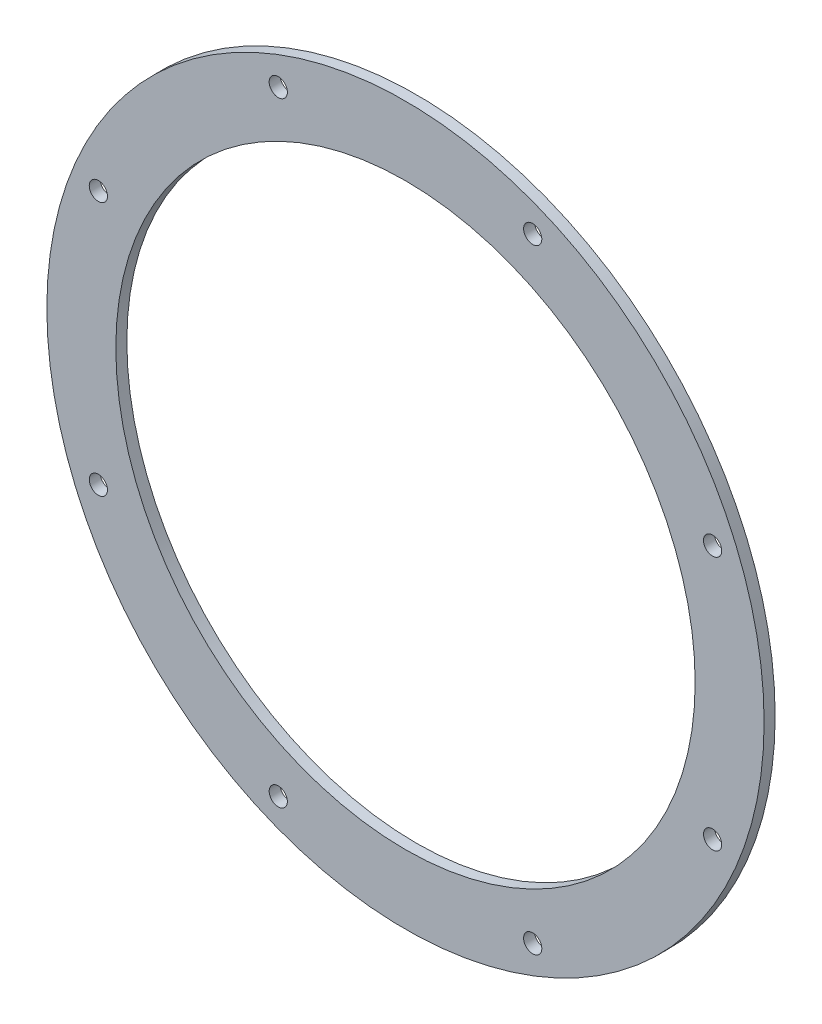
ISO-10303-21;
HEADER;
FILE_DESCRIPTION(('STEP AP214'),'2;1');
FILE_NAME('part.step','',(''),(''),'','','');
FILE_SCHEMA(('AUTOMOTIVE_DESIGN { 1 0 10303 214 1 1 1 1 }'));
ENDSEC;
DATA;
#1=APPLICATION_CONTEXT('core data for automotive mechanical design processes');
#2=APPLICATION_PROTOCOL_DEFINITION('international standard','automotive_design',2000,#1);
#3=PRODUCT_CONTEXT('',#1,'mechanical');
#4=PRODUCT('Part','Part','',(#3));
#5=PRODUCT_RELATED_PRODUCT_CATEGORY('part','',(#4));
#6=PRODUCT_DEFINITION_FORMATION('','',#4);
#7=PRODUCT_DEFINITION_CONTEXT('part definition',#1,'design');
#8=PRODUCT_DEFINITION('design','',#6,#7);
#9=PRODUCT_DEFINITION_SHAPE('','',#8);
#10=(LENGTH_UNIT() NAMED_UNIT(*) SI_UNIT(.MILLI.,.METRE.));
#11=(NAMED_UNIT(*) PLANE_ANGLE_UNIT() SI_UNIT($,.RADIAN.));
#12=(NAMED_UNIT(*) SI_UNIT($,.STERADIAN.) SOLID_ANGLE_UNIT());
#13=UNCERTAINTY_MEASURE_WITH_UNIT(LENGTH_MEASURE(1.E-05),#10,'distance_accuracy_value','');
#14=(GEOMETRIC_REPRESENTATION_CONTEXT(3) GLOBAL_UNCERTAINTY_ASSIGNED_CONTEXT((#13)) GLOBAL_UNIT_ASSIGNED_CONTEXT((#10,
#11,#12)) REPRESENTATION_CONTEXT('',''));
#15=CARTESIAN_POINT('',(0.,0.,0.));
#16=DIRECTION('',(0.,0.,1.));
#17=DIRECTION('',(1.,0.,0.));
#18=AXIS2_PLACEMENT_3D('',#15,#16,#17);
#19=CARTESIAN_POINT('',(46.1133535999919,-389.818577418843,-510.25));
#20=DIRECTION('',(0.,0.,-1.));
#21=DIRECTION('',(-1.,0.,0.));
#22=AXIS2_PLACEMENT_3D('',#19,#20,#21);
#23=CYLINDRICAL_SURFACE('',#22,3.29999999999999);
#24=CARTESIAN_POINT('',(46.1133535999919,-389.818577418843,-510.25));
#25=DIRECTION('',(0.,0.,-1.));
#26=DIRECTION('',(-1.,0.,0.));
#27=AXIS2_PLACEMENT_3D('',#24,#25,#26);
#28=CIRCLE('',#27,3.29999999999999);
#29=CARTESIAN_POINT('',(42.8133535999919,-389.818577418843,-510.25));
#30=VERTEX_POINT('',#29);
#31=EDGE_CURVE('E80',#30,#30,#28,.T.);
#32=ORIENTED_EDGE('',*,*,#31,.F.);
#33=EDGE_LOOP('',(#32));
#34=FACE_BOUND('',#33,.T.);
#35=CARTESIAN_POINT('',(46.1133535999919,-389.818577418843,-514.25));
#36=DIRECTION('',(0.,0.,-1.));
#37=DIRECTION('',(-1.,0.,0.));
#38=AXIS2_PLACEMENT_3D('',#35,#36,#37);
#39=CIRCLE('',#38,3.29999999999999);
#40=CARTESIAN_POINT('',(42.8133535999919,-389.818577418843,-514.25));
#41=VERTEX_POINT('',#40);
#42=EDGE_CURVE('E52',#41,#41,#39,.T.);
#43=ORIENTED_EDGE('',*,*,#42,.T.);
#44=EDGE_LOOP('',(#43));
#45=FACE_BOUND('',#44,.T.);
#46=ADVANCED_FACE('F35',(#34,#45),#23,.F.);
#47=CARTESIAN_POINT('',(111.32748366761,-324.604447351226,-510.25));
#48=DIRECTION('',(0.,0.,-1.));
#49=DIRECTION('',(-1.,0.,0.));
#50=AXIS2_PLACEMENT_3D('',#47,#48,#49);
#51=CYLINDRICAL_SURFACE('',#50,3.29999999999999);
#52=CARTESIAN_POINT('',(111.32748366761,-324.604447351226,-510.25));
#53=DIRECTION('',(0.,0.,-1.));
#54=DIRECTION('',(-1.,0.,0.));
#55=AXIS2_PLACEMENT_3D('',#52,#53,#54);
#56=CIRCLE('',#55,3.29999999999999);
#57=CARTESIAN_POINT('',(108.02748366761,-324.604447351226,-510.25));
#58=VERTEX_POINT('',#57);
#59=EDGE_CURVE('E84',#58,#58,#56,.T.);
#60=ORIENTED_EDGE('',*,*,#59,.F.);
#61=EDGE_LOOP('',(#60));
#62=FACE_BOUND('',#61,.T.);
#63=CARTESIAN_POINT('',(111.32748366761,-324.604447351226,-514.25));
#64=DIRECTION('',(0.,0.,-1.));
#65=DIRECTION('',(-1.,0.,0.));
#66=AXIS2_PLACEMENT_3D('',#63,#64,#65);
#67=CIRCLE('',#66,3.29999999999999);
#68=CARTESIAN_POINT('',(108.02748366761,-324.604447351226,-514.25));
#69=VERTEX_POINT('',#68);
#70=EDGE_CURVE('E55',#69,#69,#67,.T.);
#71=ORIENTED_EDGE('',*,*,#70,.T.);
#72=EDGE_LOOP('',(#71));
#73=FACE_BOUND('',#72,.T.);
#74=ADVANCED_FACE('F132',(#62,#73),#51,.F.);
#75=CARTESIAN_POINT('',(111.32748366761,-232.37774015124,-510.25));
#76=DIRECTION('',(0.,0.,-1.));
#77=DIRECTION('',(-1.,0.,0.));
#78=AXIS2_PLACEMENT_3D('',#75,#76,#77);
#79=CYLINDRICAL_SURFACE('',#78,3.29999999999999);
#80=CARTESIAN_POINT('',(111.32748366761,-232.37774015124,-510.25));
#81=DIRECTION('',(0.,0.,-1.));
#82=DIRECTION('',(-1.,0.,0.));
#83=AXIS2_PLACEMENT_3D('',#80,#81,#82);
#84=CIRCLE('',#83,3.29999999999999);
#85=CARTESIAN_POINT('',(108.02748366761,-232.37774015124,-510.25));
#86=VERTEX_POINT('',#85);
#87=EDGE_CURVE('E89',#86,#86,#84,.T.);
#88=ORIENTED_EDGE('',*,*,#87,.F.);
#89=EDGE_LOOP('',(#88));
#90=FACE_BOUND('',#89,.T.);
#91=CARTESIAN_POINT('',(111.32748366761,-232.37774015124,-514.25));
#92=DIRECTION('',(0.,0.,-1.));
#93=DIRECTION('',(-1.,0.,0.));
#94=AXIS2_PLACEMENT_3D('',#91,#92,#93);
#95=CIRCLE('',#94,3.29999999999999);
#96=CARTESIAN_POINT('',(108.02748366761,-232.37774015124,-514.25));
#97=VERTEX_POINT('',#96);
#98=EDGE_CURVE('E58',#97,#97,#95,.T.);
#99=ORIENTED_EDGE('',*,*,#98,.T.);
#100=EDGE_LOOP('',(#99));
#101=FACE_BOUND('',#100,.T.);
#102=ADVANCED_FACE('F137',(#90,#101),#79,.F.);
#103=CARTESIAN_POINT('',(46.1133535999934,-167.163610083622,-510.25));
#104=DIRECTION('',(0.,0.,-1.));
#105=DIRECTION('',(-1.,0.,0.));
#106=AXIS2_PLACEMENT_3D('',#103,#104,#105);
#107=CYLINDRICAL_SURFACE('',#106,3.29999999999999);
#108=CARTESIAN_POINT('',(46.1133535999934,-167.163610083622,-510.25));
#109=DIRECTION('',(0.,0.,-1.));
#110=DIRECTION('',(-1.,0.,0.));
#111=AXIS2_PLACEMENT_3D('',#108,#109,#110);
#112=CIRCLE('',#111,3.29999999999999);
#113=CARTESIAN_POINT('',(42.8133535999934,-167.163610083622,-510.25));
#114=VERTEX_POINT('',#113);
#115=EDGE_CURVE('E94',#114,#114,#112,.T.);
#116=ORIENTED_EDGE('',*,*,#115,.F.);
#117=EDGE_LOOP('',(#116));
#118=FACE_BOUND('',#117,.T.);
#119=CARTESIAN_POINT('',(46.1133535999934,-167.163610083622,-514.25));
#120=DIRECTION('',(0.,0.,-1.));
#121=DIRECTION('',(-1.,0.,0.));
#122=AXIS2_PLACEMENT_3D('',#119,#120,#121);
#123=CIRCLE('',#122,3.29999999999999);
#124=CARTESIAN_POINT('',(42.8133535999934,-167.163610083622,-514.25));
#125=VERTEX_POINT('',#124);
#126=EDGE_CURVE('E61',#125,#125,#123,.T.);
#127=ORIENTED_EDGE('',*,*,#126,.T.);
#128=EDGE_LOOP('',(#127));
#129=FACE_BOUND('',#128,.T.);
#130=ADVANCED_FACE('F144',(#118,#129),#107,.F.);
#131=CARTESIAN_POINT('',(-46.1133535999927,-167.163610083622,-510.25));
#132=DIRECTION('',(0.,0.,-1.));
#133=DIRECTION('',(-1.,0.,0.));
#134=AXIS2_PLACEMENT_3D('',#131,#132,#133);
#135=CYLINDRICAL_SURFACE('',#134,3.29999999999999);
#136=CARTESIAN_POINT('',(-46.1133535999927,-167.163610083622,-510.25));
#137=DIRECTION('',(0.,0.,-1.));
#138=DIRECTION('',(-1.,0.,0.));
#139=AXIS2_PLACEMENT_3D('',#136,#137,#138);
#140=CIRCLE('',#139,3.29999999999999);
#141=CARTESIAN_POINT('',(-49.4133535999927,-167.163610083622,-510.25));
#142=VERTEX_POINT('',#141);
#143=EDGE_CURVE('E97',#142,#142,#140,.T.);
#144=ORIENTED_EDGE('',*,*,#143,.F.);
#145=EDGE_LOOP('',(#144));
#146=FACE_BOUND('',#145,.T.);
#147=CARTESIAN_POINT('',(-46.1133535999927,-167.163610083622,-514.25));
#148=DIRECTION('',(0.,0.,-1.));
#149=DIRECTION('',(-1.,0.,0.));
#150=AXIS2_PLACEMENT_3D('',#147,#148,#149);
#151=CIRCLE('',#150,3.29999999999999);
#152=CARTESIAN_POINT('',(-49.4133535999927,-167.163610083622,-514.25));
#153=VERTEX_POINT('',#152);
#154=EDGE_CURVE('E64',#153,#153,#151,.T.);
#155=ORIENTED_EDGE('',*,*,#154,.T.);
#156=EDGE_LOOP('',(#155));
#157=FACE_BOUND('',#156,.T.);
#158=ADVANCED_FACE('F148',(#146,#157),#135,.F.);
#159=CARTESIAN_POINT('',(-111.32748366761,-232.377740151238,-510.25));
#160=DIRECTION('',(0.,0.,-1.));
#161=DIRECTION('',(-1.,0.,0.));
#162=AXIS2_PLACEMENT_3D('',#159,#160,#161);
#163=CYLINDRICAL_SURFACE('',#162,3.29999999999999);
#164=CARTESIAN_POINT('',(-111.32748366761,-232.377740151238,-510.25));
#165=DIRECTION('',(0.,0.,-1.));
#166=DIRECTION('',(-1.,0.,0.));
#167=AXIS2_PLACEMENT_3D('',#164,#165,#166);
#168=CIRCLE('',#167,3.29999999999999);
#169=CARTESIAN_POINT('',(-114.62748366761,-232.377740151238,-510.25));
#170=VERTEX_POINT('',#169);
#171=EDGE_CURVE('E100',#170,#170,#168,.T.);
#172=ORIENTED_EDGE('',*,*,#171,.F.);
#173=EDGE_LOOP('',(#172));
#174=FACE_BOUND('',#173,.T.);
#175=CARTESIAN_POINT('',(-111.32748366761,-232.377740151238,-514.25));
#176=DIRECTION('',(0.,0.,-1.));
#177=DIRECTION('',(-1.,0.,0.));
#178=AXIS2_PLACEMENT_3D('',#175,#176,#177);
#179=CIRCLE('',#178,3.29999999999999);
#180=CARTESIAN_POINT('',(-114.62748366761,-232.377740151238,-514.25));
#181=VERTEX_POINT('',#180);
#182=EDGE_CURVE('E67',#181,#181,#179,.T.);
#183=ORIENTED_EDGE('',*,*,#182,.T.);
#184=EDGE_LOOP('',(#183));
#185=FACE_BOUND('',#184,.T.);
#186=ADVANCED_FACE('F152',(#174,#185),#163,.F.);
#187=CARTESIAN_POINT('',(-111.32748366761,-324.604447351225,-510.25));
#188=DIRECTION('',(0.,0.,-1.));
#189=DIRECTION('',(-1.,0.,0.));
#190=AXIS2_PLACEMENT_3D('',#187,#188,#189);
#191=CYLINDRICAL_SURFACE('',#190,3.29999999999999);
#192=CARTESIAN_POINT('',(-111.32748366761,-324.604447351225,-510.25));
#193=DIRECTION('',(0.,0.,-1.));
#194=DIRECTION('',(-1.,0.,0.));
#195=AXIS2_PLACEMENT_3D('',#192,#193,#194);
#196=CIRCLE('',#195,3.29999999999999);
#197=CARTESIAN_POINT('',(-114.62748366761,-324.604447351225,-510.25));
#198=VERTEX_POINT('',#197);
#199=EDGE_CURVE('E103',#198,#198,#196,.T.);
#200=ORIENTED_EDGE('',*,*,#199,.F.);
#201=EDGE_LOOP('',(#200));
#202=FACE_BOUND('',#201,.T.);
#203=CARTESIAN_POINT('',(-111.32748366761,-324.604447351225,-514.25));
#204=DIRECTION('',(0.,0.,-1.));
#205=DIRECTION('',(-1.,0.,0.));
#206=AXIS2_PLACEMENT_3D('',#203,#204,#205);
#207=CIRCLE('',#206,3.29999999999999);
#208=CARTESIAN_POINT('',(-114.62748366761,-324.604447351225,-514.25));
#209=VERTEX_POINT('',#208);
#210=EDGE_CURVE('E70',#209,#209,#207,.T.);
#211=ORIENTED_EDGE('',*,*,#210,.T.);
#212=EDGE_LOOP('',(#211));
#213=FACE_BOUND('',#212,.T.);
#214=ADVANCED_FACE('F115',(#202,#213),#191,.F.);
#215=CARTESIAN_POINT('',(-46.1133535999934,-389.818577418842,-510.25));
#216=DIRECTION('',(0.,0.,-1.));
#217=DIRECTION('',(-1.,0.,0.));
#218=AXIS2_PLACEMENT_3D('',#215,#216,#217);
#219=CYLINDRICAL_SURFACE('',#218,3.29999999999999);
#220=CARTESIAN_POINT('',(-46.1133535999934,-389.818577418842,-510.25));
#221=DIRECTION('',(0.,0.,-1.));
#222=DIRECTION('',(-1.,0.,0.));
#223=AXIS2_PLACEMENT_3D('',#220,#221,#222);
#224=CIRCLE('',#223,3.29999999999999);
#225=CARTESIAN_POINT('',(-49.4133535999934,-389.818577418842,-510.25));
#226=VERTEX_POINT('',#225);
#227=EDGE_CURVE('E48',#226,#226,#224,.T.);
#228=ORIENTED_EDGE('',*,*,#227,.F.);
#229=EDGE_LOOP('',(#228));
#230=FACE_BOUND('',#229,.T.);
#231=CARTESIAN_POINT('',(-46.1133535999934,-389.818577418842,-514.25));
#232=DIRECTION('',(0.,0.,-1.));
#233=DIRECTION('',(-1.,0.,0.));
#234=AXIS2_PLACEMENT_3D('',#231,#232,#233);
#235=CIRCLE('',#234,3.29999999999999);
#236=CARTESIAN_POINT('',(-49.4133535999934,-389.818577418842,-514.25));
#237=VERTEX_POINT('',#236);
#238=EDGE_CURVE('E73',#237,#237,#235,.T.);
#239=ORIENTED_EDGE('',*,*,#238,.T.);
#240=EDGE_LOOP('',(#239));
#241=FACE_BOUND('',#240,.T.);
#242=ADVANCED_FACE('F111',(#230,#241),#219,.F.);
#243=CARTESIAN_POINT('',(0.,-278.491093751232,-510.25));
#244=DIRECTION('',(0.,0.,-1.));
#245=DIRECTION('',(-1.,0.,0.));
#246=AXIS2_PLACEMENT_3D('',#243,#244,#245);
#247=CYLINDRICAL_SURFACE('',#246,105.);
#248=CARTESIAN_POINT('',(0.,-278.491093751232,-510.25));
#249=DIRECTION('',(0.,0.,-1.));
#250=DIRECTION('',(-1.,0.,0.));
#251=AXIS2_PLACEMENT_3D('',#248,#249,#250);
#252=CIRCLE('',#251,105.);
#253=CARTESIAN_POINT('',(-105.,-278.491093751232,-510.25));
#254=VERTEX_POINT('',#253);
#255=EDGE_CURVE('E43',#254,#254,#252,.T.);
#256=ORIENTED_EDGE('',*,*,#255,.F.);
#257=EDGE_LOOP('',(#256));
#258=FACE_BOUND('',#257,.T.);
#259=CARTESIAN_POINT('',(0.,-278.491093751232,-514.25));
#260=DIRECTION('',(0.,0.,-1.));
#261=DIRECTION('',(-1.,0.,0.));
#262=AXIS2_PLACEMENT_3D('',#259,#260,#261);
#263=CIRCLE('',#262,105.);
#264=CARTESIAN_POINT('',(-105.,-278.491093751232,-514.25));
#265=VERTEX_POINT('',#264);
#266=EDGE_CURVE('E75',#265,#265,#263,.T.);
#267=ORIENTED_EDGE('',*,*,#266,.T.);
#268=EDGE_LOOP('',(#267));
#269=FACE_BOUND('',#268,.T.);
#270=ADVANCED_FACE('F114',(#258,#269),#247,.F.);
#271=CARTESIAN_POINT('',(0.,-278.491093751232,-510.25));
#272=DIRECTION('',(0.,0.,-1.));
#273=DIRECTION('',(-1.,0.,0.));
#274=AXIS2_PLACEMENT_3D('',#271,#272,#273);
#275=CYLINDRICAL_SURFACE('',#274,130.);
#276=CARTESIAN_POINT('',(0.,-278.491093751232,-510.25));
#277=DIRECTION('',(0.,0.,-1.));
#278=DIRECTION('',(-1.,0.,0.));
#279=AXIS2_PLACEMENT_3D('',#276,#277,#278);
#280=CIRCLE('',#279,130.);
#281=CARTESIAN_POINT('',(-130.,-278.491093751232,-510.25));
#282=VERTEX_POINT('',#281);
#283=EDGE_CURVE('E10',#282,#282,#280,.T.);
#284=ORIENTED_EDGE('',*,*,#283,.T.);
#285=EDGE_LOOP('',(#284));
#286=FACE_BOUND('',#285,.T.);
#287=CARTESIAN_POINT('',(0.,-278.491093751232,-514.25));
#288=DIRECTION('',(0.,0.,-1.));
#289=DIRECTION('',(-1.,0.,0.));
#290=AXIS2_PLACEMENT_3D('',#287,#288,#289);
#291=CIRCLE('',#290,130.);
#292=CARTESIAN_POINT('',(-130.,-278.491093751232,-514.25));
#293=VERTEX_POINT('',#292);
#294=EDGE_CURVE('E39',#293,#293,#291,.T.);
#295=ORIENTED_EDGE('',*,*,#294,.F.);
#296=EDGE_LOOP('',(#295));
#297=FACE_BOUND('',#296,.T.);
#298=ADVANCED_FACE('F37',(#286,#297),#275,.T.);
#299=CARTESIAN_POINT('',(0.,-278.491093751232,-510.25));
#300=DIRECTION('',(0.,0.,-1.));
#301=DIRECTION('',(-1.,0.,0.));
#302=AXIS2_PLACEMENT_3D('',#299,#300,#301);
#303=PLANE('',#302);
#304=ORIENTED_EDGE('',*,*,#31,.T.);
#305=EDGE_LOOP('',(#304));
#306=FACE_BOUND('',#305,.T.);
#307=ORIENTED_EDGE('',*,*,#59,.T.);
#308=EDGE_LOOP('',(#307));
#309=FACE_BOUND('',#308,.T.);
#310=ORIENTED_EDGE('',*,*,#87,.T.);
#311=EDGE_LOOP('',(#310));
#312=FACE_BOUND('',#311,.T.);
#313=ORIENTED_EDGE('',*,*,#115,.T.);
#314=EDGE_LOOP('',(#313));
#315=FACE_BOUND('',#314,.T.);
#316=ORIENTED_EDGE('',*,*,#143,.T.);
#317=EDGE_LOOP('',(#316));
#318=FACE_BOUND('',#317,.T.);
#319=ORIENTED_EDGE('',*,*,#171,.T.);
#320=EDGE_LOOP('',(#319));
#321=FACE_BOUND('',#320,.T.);
#322=ORIENTED_EDGE('',*,*,#199,.T.);
#323=EDGE_LOOP('',(#322));
#324=FACE_BOUND('',#323,.T.);
#325=ORIENTED_EDGE('',*,*,#227,.T.);
#326=EDGE_LOOP('',(#325));
#327=FACE_BOUND('',#326,.T.);
#328=ORIENTED_EDGE('',*,*,#255,.T.);
#329=EDGE_LOOP('',(#328));
#330=FACE_BOUND('',#329,.T.);
#331=ORIENTED_EDGE('',*,*,#283,.F.);
#332=EDGE_LOOP('',(#331));
#333=FACE_BOUND('',#332,.T.);
#334=ADVANCED_FACE('F108',(#306,#309,#312,#315,#318,#321,#324,#327,#330,#333),#303,.F.);
#335=CARTESIAN_POINT('',(0.,-278.491093751232,-514.25));
#336=DIRECTION('',(0.,0.,-1.));
#337=DIRECTION('',(-1.,0.,0.));
#338=AXIS2_PLACEMENT_3D('',#335,#336,#337);
#339=PLANE('',#338);
#340=ORIENTED_EDGE('',*,*,#42,.F.);
#341=EDGE_LOOP('',(#340));
#342=FACE_BOUND('',#341,.T.);
#343=ORIENTED_EDGE('',*,*,#70,.F.);
#344=EDGE_LOOP('',(#343));
#345=FACE_BOUND('',#344,.T.);
#346=ORIENTED_EDGE('',*,*,#98,.F.);
#347=EDGE_LOOP('',(#346));
#348=FACE_BOUND('',#347,.T.);
#349=ORIENTED_EDGE('',*,*,#126,.F.);
#350=EDGE_LOOP('',(#349));
#351=FACE_BOUND('',#350,.T.);
#352=ORIENTED_EDGE('',*,*,#154,.F.);
#353=EDGE_LOOP('',(#352));
#354=FACE_BOUND('',#353,.T.);
#355=ORIENTED_EDGE('',*,*,#182,.F.);
#356=EDGE_LOOP('',(#355));
#357=FACE_BOUND('',#356,.T.);
#358=ORIENTED_EDGE('',*,*,#210,.F.);
#359=EDGE_LOOP('',(#358));
#360=FACE_BOUND('',#359,.T.);
#361=ORIENTED_EDGE('',*,*,#238,.F.);
#362=EDGE_LOOP('',(#361));
#363=FACE_BOUND('',#362,.T.);
#364=ORIENTED_EDGE('',*,*,#266,.F.);
#365=EDGE_LOOP('',(#364));
#366=FACE_BOUND('',#365,.T.);
#367=ORIENTED_EDGE('',*,*,#294,.T.);
#368=EDGE_LOOP('',(#367));
#369=FACE_BOUND('',#368,.T.);
#370=ADVANCED_FACE('F119',(#342,#345,#348,#351,#354,#357,#360,#363,#366,#369),#339,.T.);
#371=CLOSED_SHELL('',(#46,#74,#102,#130,#158,#186,#214,#242,#270,#298,#334,#370));
#372=MANIFOLD_SOLID_BREP('B2',#371);
#373=ADVANCED_BREP_SHAPE_REPRESENTATION('',(#18,#372),#14);
#374=SHAPE_DEFINITION_REPRESENTATION(#9,#373);
ENDSEC;
END-ISO-10303-21;
